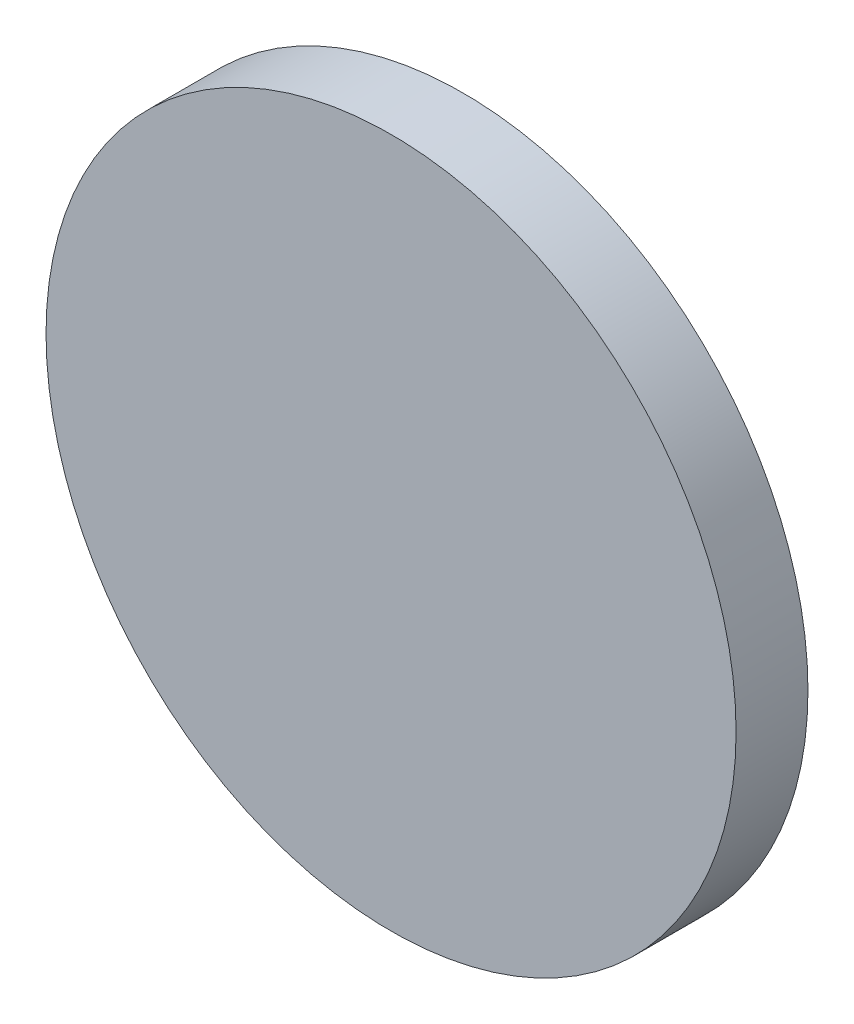
ISO-10303-21;
HEADER;
FILE_DESCRIPTION(('STEP AP214'),'2;1');
FILE_NAME('part.step','',(''),(''),'','','');
FILE_SCHEMA(('AUTOMOTIVE_DESIGN { 1 0 10303 214 1 1 1 1 }'));
ENDSEC;
DATA;
#1=APPLICATION_CONTEXT('core data for automotive mechanical design processes');
#2=APPLICATION_PROTOCOL_DEFINITION('international standard','automotive_design',2000,#1);
#3=PRODUCT_CONTEXT('',#1,'mechanical');
#4=PRODUCT('Part','Part','',(#3));
#5=PRODUCT_RELATED_PRODUCT_CATEGORY('part','',(#4));
#6=PRODUCT_DEFINITION_FORMATION('','',#4);
#7=PRODUCT_DEFINITION_CONTEXT('part definition',#1,'design');
#8=PRODUCT_DEFINITION('design','',#6,#7);
#9=PRODUCT_DEFINITION_SHAPE('','',#8);
#10=(LENGTH_UNIT() NAMED_UNIT(*) SI_UNIT(.MILLI.,.METRE.));
#11=(NAMED_UNIT(*) PLANE_ANGLE_UNIT() SI_UNIT($,.RADIAN.));
#12=(NAMED_UNIT(*) SI_UNIT($,.STERADIAN.) SOLID_ANGLE_UNIT());
#13=UNCERTAINTY_MEASURE_WITH_UNIT(LENGTH_MEASURE(1.E-05),#10,'distance_accuracy_value','');
#14=(GEOMETRIC_REPRESENTATION_CONTEXT(3) GLOBAL_UNCERTAINTY_ASSIGNED_CONTEXT((#13)) GLOBAL_UNIT_ASSIGNED_CONTEXT((#10,
#11,#12)) REPRESENTATION_CONTEXT('',''));
#15=CARTESIAN_POINT('',(0.,0.,0.));
#16=DIRECTION('',(0.,0.,1.));
#17=DIRECTION('',(1.,0.,0.));
#18=AXIS2_PLACEMENT_3D('',#15,#16,#17);
#19=CARTESIAN_POINT('',(0.,0.,50.));
#20=DIRECTION('',(0.,0.,-1.));
#21=DIRECTION('',(-1.,0.,0.));
#22=AXIS2_PLACEMENT_3D('',#19,#20,#21);
#23=CYLINDRICAL_SURFACE('',#22,240.);
#24=CARTESIAN_POINT('',(0.,0.,50.));
#25=DIRECTION('',(0.,0.,1.));
#26=DIRECTION('',(1.,0.,0.));
#27=AXIS2_PLACEMENT_3D('',#24,#25,#26);
#28=CIRCLE('',#27,240.);
#29=CARTESIAN_POINT('',(240.,0.,50.));
#30=VERTEX_POINT('',#29);
#31=EDGE_CURVE('E10',#30,#30,#28,.T.);
#32=ORIENTED_EDGE('',*,*,#31,.F.);
#33=EDGE_LOOP('',(#32));
#34=FACE_BOUND('',#33,.T.);
#35=CARTESIAN_POINT('',(0.,0.,0.));
#36=DIRECTION('',(0.,0.,1.));
#37=DIRECTION('',(1.,0.,0.));
#38=AXIS2_PLACEMENT_3D('',#35,#36,#37);
#39=CIRCLE('',#38,240.);
#40=CARTESIAN_POINT('',(240.,0.,0.));
#41=VERTEX_POINT('',#40);
#42=EDGE_CURVE('E36',#41,#41,#39,.T.);
#43=ORIENTED_EDGE('',*,*,#42,.T.);
#44=EDGE_LOOP('',(#43));
#45=FACE_BOUND('',#44,.T.);
#46=ADVANCED_FACE('F33',(#34,#45),#23,.T.);
#47=CARTESIAN_POINT('',(0.,0.,50.));
#48=DIRECTION('',(0.,0.,1.));
#49=DIRECTION('',(1.,0.,0.));
#50=AXIS2_PLACEMENT_3D('',#47,#48,#49);
#51=PLANE('',#50);
#52=ORIENTED_EDGE('',*,*,#31,.T.);
#53=EDGE_LOOP('',(#52));
#54=FACE_BOUND('',#53,.T.);
#55=ADVANCED_FACE('F48',(#54),#51,.T.);
#56=CARTESIAN_POINT('',(0.,0.,0.));
#57=DIRECTION('',(0.,0.,1.));
#58=DIRECTION('',(1.,0.,0.));
#59=AXIS2_PLACEMENT_3D('',#56,#57,#58);
#60=PLANE('',#59);
#61=ORIENTED_EDGE('',*,*,#42,.F.);
#62=EDGE_LOOP('',(#61));
#63=FACE_BOUND('',#62,.T.);
#64=ADVANCED_FACE('F46',(#63),#60,.F.);
#65=CLOSED_SHELL('',(#46,#55,#64));
#66=MANIFOLD_SOLID_BREP('B2',#65);
#67=ADVANCED_BREP_SHAPE_REPRESENTATION('',(#18,#66),#14);
#68=SHAPE_DEFINITION_REPRESENTATION(#9,#67);
ENDSEC;
END-ISO-10303-21;
